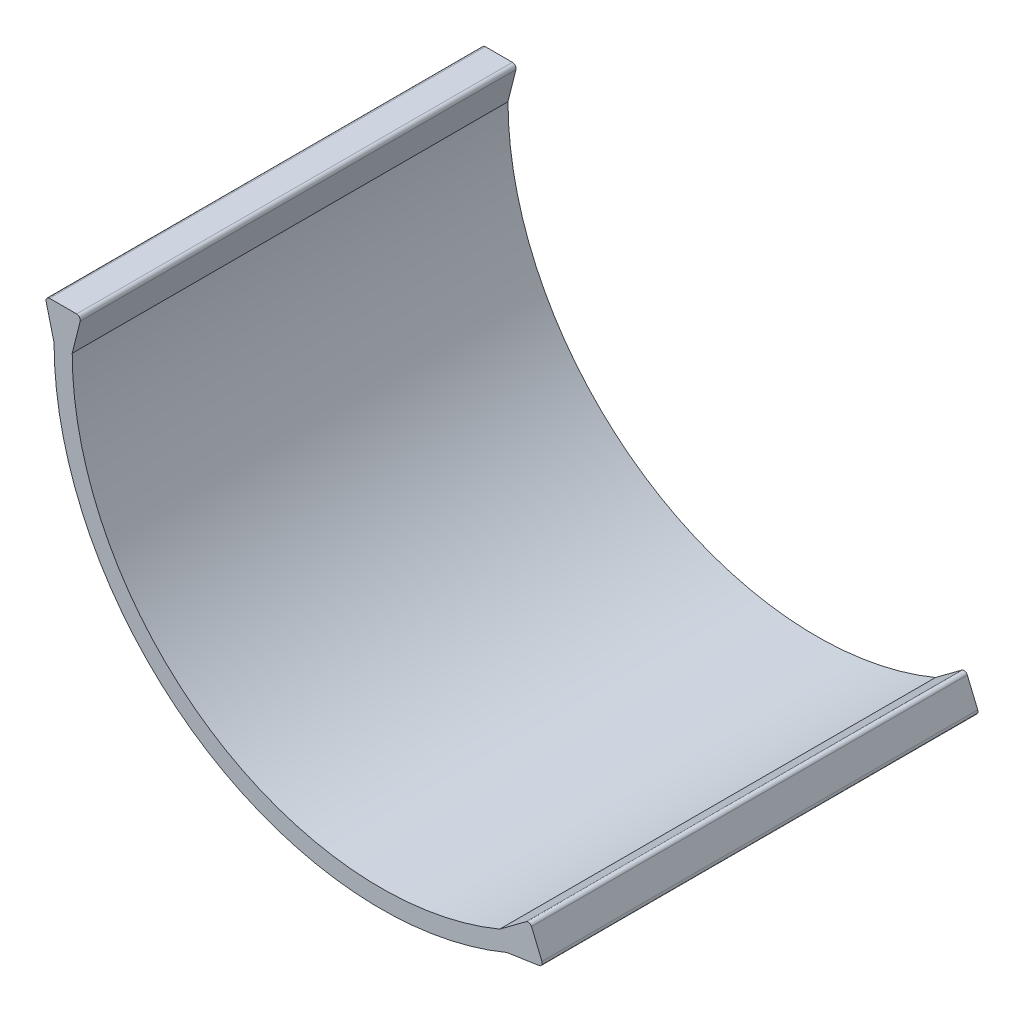
ISO-10303-21;
HEADER;
FILE_DESCRIPTION(('STEP AP214'),'2;1');
FILE_NAME('part.step','',(''),(''),'','','');
FILE_SCHEMA(('AUTOMOTIVE_DESIGN { 1 0 10303 214 1 1 1 1 }'));
ENDSEC;
DATA;
#1=APPLICATION_CONTEXT('core data for automotive mechanical design processes');
#2=APPLICATION_PROTOCOL_DEFINITION('international standard','automotive_design',2000,#1);
#3=PRODUCT_CONTEXT('',#1,'mechanical');
#4=PRODUCT('Part','Part','',(#3));
#5=PRODUCT_RELATED_PRODUCT_CATEGORY('part','',(#4));
#6=PRODUCT_DEFINITION_FORMATION('','',#4);
#7=PRODUCT_DEFINITION_CONTEXT('part definition',#1,'design');
#8=PRODUCT_DEFINITION('design','',#6,#7);
#9=PRODUCT_DEFINITION_SHAPE('','',#8);
#10=(LENGTH_UNIT() NAMED_UNIT(*) SI_UNIT(.MILLI.,.METRE.));
#11=(NAMED_UNIT(*) PLANE_ANGLE_UNIT() SI_UNIT($,.RADIAN.));
#12=(NAMED_UNIT(*) SI_UNIT($,.STERADIAN.) SOLID_ANGLE_UNIT());
#13=UNCERTAINTY_MEASURE_WITH_UNIT(LENGTH_MEASURE(1.E-05),#10,'distance_accuracy_value','');
#14=(GEOMETRIC_REPRESENTATION_CONTEXT(3) GLOBAL_UNCERTAINTY_ASSIGNED_CONTEXT((#13)) GLOBAL_UNIT_ASSIGNED_CONTEXT((#10,
#11,#12)) REPRESENTATION_CONTEXT('',''));
#15=CARTESIAN_POINT('',(0.,0.,0.));
#16=DIRECTION('',(0.,0.,1.));
#17=DIRECTION('',(1.,0.,0.));
#18=AXIS2_PLACEMENT_3D('',#15,#16,#17);
#19=CARTESIAN_POINT('',(0.,0.,120.));
#20=DIRECTION('',(0.,0.,-1.));
#21=DIRECTION('',(-1.,0.,0.));
#22=AXIS2_PLACEMENT_3D('',#19,#20,#21);
#23=CYLINDRICAL_SURFACE('',#22,90.);
#24=CARTESIAN_POINT('',(0.,0.,0.));
#25=DIRECTION('',(0.,0.,1.));
#26=DIRECTION('',(1.,0.,0.));
#27=AXIS2_PLACEMENT_3D('',#24,#25,#26);
#28=CIRCLE('',#27,90.);
#29=CARTESIAN_POINT('',(-90.,0.,0.));
#30=VERTEX_POINT('',#29);
#31=CARTESIAN_POINT('',(34.639883029955,-83.0667111644071,0.));
#32=VERTEX_POINT('',#31);
#33=EDGE_CURVE('E211',#30,#32,#28,.T.);
#34=ORIENTED_EDGE('',*,*,#33,.T.);
#35=DIRECTION('',(0.,0.,-1.));
#36=VECTOR('',#35,1.);
#37=CARTESIAN_POINT('',(34.639883029955,-83.0667111644071,120.));
#38=LINE('',#37,#36);
#39=CARTESIAN_POINT('',(34.639883029955,-83.0667111644071,120.));
#40=VERTEX_POINT('',#39);
#41=EDGE_CURVE('E12',#40,#32,#38,.T.);
#42=ORIENTED_EDGE('',*,*,#41,.F.);
#43=CARTESIAN_POINT('',(0.,0.,120.));
#44=DIRECTION('',(0.,0.,1.));
#45=DIRECTION('',(1.,0.,0.));
#46=AXIS2_PLACEMENT_3D('',#43,#44,#45);
#47=CIRCLE('',#46,90.);
#48=CARTESIAN_POINT('',(-90.,0.,120.));
#49=VERTEX_POINT('',#48);
#50=EDGE_CURVE('E217',#49,#40,#47,.T.);
#51=ORIENTED_EDGE('',*,*,#50,.F.);
#52=DIRECTION('',(0.,0.,-1.));
#53=VECTOR('',#52,1.);
#54=CARTESIAN_POINT('',(-90.,0.,120.));
#55=LINE('',#54,#53);
#56=EDGE_CURVE('E224',#49,#30,#55,.T.);
#57=ORIENTED_EDGE('',*,*,#56,.T.);
#58=EDGE_LOOP('',(#34,#42,#51,#57));
#59=FACE_BOUND('',#58,.T.);
#60=ADVANCED_FACE('F47',(#59),#23,.T.);
#61=CARTESIAN_POINT('',(0.,0.,120.));
#62=DIRECTION('',(0.,0.,-1.));
#63=DIRECTION('',(-1.,0.,0.));
#64=AXIS2_PLACEMENT_3D('',#61,#62,#63);
#65=CYLINDRICAL_SURFACE('',#64,85.);
#66=CARTESIAN_POINT('',(0.,0.,0.));
#67=DIRECTION('',(0.,0.,1.));
#68=DIRECTION('',(1.,0.,0.));
#69=AXIS2_PLACEMENT_3D('',#66,#67,#68);
#70=CIRCLE('',#69,85.);
#71=CARTESIAN_POINT('',(-85.,0.,0.));
#72=VERTEX_POINT('',#71);
#73=CARTESIAN_POINT('',(32.7154450838464,-78.4518938774956,0.));
#74=VERTEX_POINT('',#73);
#75=EDGE_CURVE('E221',#72,#74,#70,.T.);
#76=ORIENTED_EDGE('',*,*,#75,.F.);
#77=DIRECTION('',(0.,0.,-1.));
#78=VECTOR('',#77,1.);
#79=CARTESIAN_POINT('',(-85.,0.,120.));
#80=LINE('',#79,#78);
#81=CARTESIAN_POINT('',(-85.,0.,120.));
#82=VERTEX_POINT('',#81);
#83=EDGE_CURVE('E155',#82,#72,#80,.T.);
#84=ORIENTED_EDGE('',*,*,#83,.F.);
#85=CARTESIAN_POINT('',(0.,0.,120.));
#86=DIRECTION('',(0.,0.,1.));
#87=DIRECTION('',(1.,0.,0.));
#88=AXIS2_PLACEMENT_3D('',#85,#86,#87);
#89=CIRCLE('',#88,85.);
#90=CARTESIAN_POINT('',(32.7154450838464,-78.4518938774956,120.));
#91=VERTEX_POINT('',#90);
#92=EDGE_CURVE('E220',#82,#91,#89,.T.);
#93=ORIENTED_EDGE('',*,*,#92,.T.);
#94=DIRECTION('',(0.,0.,-1.));
#95=VECTOR('',#94,1.);
#96=CARTESIAN_POINT('',(32.7154450838464,-78.4518938774956,120.));
#97=LINE('',#96,#95);
#98=EDGE_CURVE('E54',#91,#74,#97,.T.);
#99=ORIENTED_EDGE('',*,*,#98,.T.);
#100=EDGE_LOOP('',(#76,#84,#93,#99));
#101=FACE_BOUND('',#100,.T.);
#102=ADVANCED_FACE('F232',(#101),#65,.F.);
#103=CARTESIAN_POINT('',(0.,0.,120.));
#104=DIRECTION('',(0.,0.,1.));
#105=DIRECTION('',(1.,0.,0.));
#106=AXIS2_PLACEMENT_3D('',#103,#104,#105);
#107=PLANE('',#106);
#108=ORIENTED_EDGE('',*,*,#50,.T.);
#109=DIRECTION('',(0.988755028108263,0.149544289060557,0.));
#110=VECTOR('',#109,1.);
#111=CARTESIAN_POINT('',(43.5653624651176,-81.716776712787,120.));
#112=LINE('',#111,#110);
#113=CARTESIAN_POINT('',(43.5653624651176,-81.716776712787,120.));
#114=VERTEX_POINT('',#113);
#115=EDGE_CURVE('E178',#40,#114,#112,.T.);
#116=ORIENTED_EDGE('',*,*,#115,.T.);
#117=CARTESIAN_POINT('',(43.415818176057,-80.7280216846787,120.));
#118=DIRECTION('',(0.,0.,1.));
#119=DIRECTION('',(-1.,0.,0.));
#120=AXIS2_PLACEMENT_3D('',#117,#118,#119);
#121=CIRCLE('',#120,0.999999999999995);
#122=CARTESIAN_POINT('',(44.3387816334393,-80.343134095457,120.));
#123=VERTEX_POINT('',#122);
#124=EDGE_CURVE('E198',#114,#123,#121,.T.);
#125=ORIENTED_EDGE('',*,*,#124,.T.);
#126=DIRECTION('',(-0.384887589221721,0.922963457382302,0.));
#127=VECTOR('',#126,1.);
#128=CARTESIAN_POINT('',(41.4758156280082,-73.4777191620114,120.));
#129=LINE('',#128,#127);
#130=CARTESIAN_POINT('',(41.4758156280082,-73.4777191620114,120.));
#131=VERTEX_POINT('',#130);
#132=EDGE_CURVE('E201',#123,#131,#129,.T.);
#133=ORIENTED_EDGE('',*,*,#132,.T.);
#134=CARTESIAN_POINT('',(40.5528521706259,-73.8626067512331,120.));
#135=DIRECTION('',(0.,0.,1.));
#136=DIRECTION('',(-1.,0.,0.));
#137=AXIS2_PLACEMENT_3D('',#134,#135,#136);
#138=CIRCLE('',#137,1.00000000000001);
#139=CARTESIAN_POINT('',(39.9556048435215,-73.060549627166,120.));
#140=VERTEX_POINT('',#139);
#141=EDGE_CURVE('E204',#131,#140,#138,.T.);
#142=ORIENTED_EDGE('',*,*,#141,.T.);
#143=DIRECTION('',(-0.80205712406703,-0.597247327104379,0.));
#144=VECTOR('',#143,1.);
#145=CARTESIAN_POINT('',(32.7154450838464,-78.4518938774956,120.));
#146=LINE('',#145,#144);
#147=EDGE_CURVE('E184',#140,#91,#146,.T.);
#148=ORIENTED_EDGE('',*,*,#147,.T.);
#149=ORIENTED_EDGE('',*,*,#92,.F.);
#150=DIRECTION('',(0.242535625036333,0.970142500145332,0.));
#151=VECTOR('',#150,1.);
#152=CARTESIAN_POINT('',(-82.8106339062591,8.75746437496367,120.));
#153=LINE('',#152,#151);
#154=CARTESIAN_POINT('',(-82.8106339062591,8.75746437496367,120.));
#155=VERTEX_POINT('',#154);
#156=EDGE_CURVE('E168',#82,#155,#153,.T.);
#157=ORIENTED_EDGE('',*,*,#156,.T.);
#158=CARTESIAN_POINT('',(-83.7807764064044,9.,120.));
#159=DIRECTION('',(0.,0.,1.));
#160=DIRECTION('',(-1.,0.,0.));
#161=AXIS2_PLACEMENT_3D('',#158,#159,#160);
#162=CIRCLE('',#161,1.);
#163=CARTESIAN_POINT('',(-83.7807764064044,10.,120.));
#164=VERTEX_POINT('',#163);
#165=EDGE_CURVE('E141',#155,#164,#162,.T.);
#166=ORIENTED_EDGE('',*,*,#165,.T.);
#167=DIRECTION('',(-1.,0.,0.));
#168=VECTOR('',#167,1.);
#169=CARTESIAN_POINT('',(-91.2192235935956,10.,120.));
#170=LINE('',#169,#168);
#171=CARTESIAN_POINT('',(-91.2192235935956,10.,120.));
#172=VERTEX_POINT('',#171);
#173=EDGE_CURVE('E171',#164,#172,#170,.T.);
#174=ORIENTED_EDGE('',*,*,#173,.T.);
#175=CARTESIAN_POINT('',(-91.2192235935956,9.,120.));
#176=DIRECTION('',(0.,0.,1.));
#177=DIRECTION('',(1.,0.,0.));
#178=AXIS2_PLACEMENT_3D('',#175,#176,#177);
#179=CIRCLE('',#178,1.);
#180=CARTESIAN_POINT('',(-92.1893660937409,8.75746437496367,120.));
#181=VERTEX_POINT('',#180);
#182=EDGE_CURVE('E160',#172,#181,#179,.T.);
#183=ORIENTED_EDGE('',*,*,#182,.T.);
#184=DIRECTION('',(0.242535625036333,-0.970142500145332,0.));
#185=VECTOR('',#184,1.);
#186=CARTESIAN_POINT('',(-90.,0.,120.));
#187=LINE('',#186,#185);
#188=EDGE_CURVE('E157',#181,#49,#187,.T.);
#189=ORIENTED_EDGE('',*,*,#188,.T.);
#190=EDGE_LOOP('',(#108,#116,#125,#133,#142,#148,#149,#157,#166,#174,#183,#189));
#191=FACE_BOUND('',#190,.T.);
#192=ADVANCED_FACE('F265',(#191),#107,.T.);
#193=CARTESIAN_POINT('',(0.,0.,0.));
#194=DIRECTION('',(0.,0.,1.));
#195=DIRECTION('',(1.,0.,0.));
#196=AXIS2_PLACEMENT_3D('',#193,#194,#195);
#197=PLANE('',#196);
#198=ORIENTED_EDGE('',*,*,#33,.F.);
#199=DIRECTION('',(0.242535625036333,-0.970142500145332,0.));
#200=VECTOR('',#199,1.);
#201=CARTESIAN_POINT('',(-90.,0.,0.));
#202=LINE('',#201,#200);
#203=CARTESIAN_POINT('',(-92.1893660937409,8.75746437496367,0.));
#204=VERTEX_POINT('',#203);
#205=EDGE_CURVE('E145',#204,#30,#202,.T.);
#206=ORIENTED_EDGE('',*,*,#205,.F.);
#207=CARTESIAN_POINT('',(-91.2192235935956,9.,0.));
#208=DIRECTION('',(0.,0.,1.));
#209=DIRECTION('',(1.,0.,0.));
#210=AXIS2_PLACEMENT_3D('',#207,#208,#209);
#211=CIRCLE('',#210,1.);
#212=CARTESIAN_POINT('',(-91.2192235935956,10.,0.));
#213=VERTEX_POINT('',#212);
#214=EDGE_CURVE('E164',#213,#204,#211,.T.);
#215=ORIENTED_EDGE('',*,*,#214,.F.);
#216=DIRECTION('',(-1.,0.,0.));
#217=VECTOR('',#216,1.);
#218=CARTESIAN_POINT('',(-91.2192235935956,10.,0.));
#219=LINE('',#218,#217);
#220=CARTESIAN_POINT('',(-83.7807764064044,10.,0.));
#221=VERTEX_POINT('',#220);
#222=EDGE_CURVE('E151',#221,#213,#219,.T.);
#223=ORIENTED_EDGE('',*,*,#222,.F.);
#224=CARTESIAN_POINT('',(-83.7807764064044,9.,0.));
#225=DIRECTION('',(0.,0.,1.));
#226=DIRECTION('',(-1.,0.,0.));
#227=AXIS2_PLACEMENT_3D('',#224,#225,#226);
#228=CIRCLE('',#227,1.);
#229=CARTESIAN_POINT('',(-82.8106339062591,8.75746437496367,0.));
#230=VERTEX_POINT('',#229);
#231=EDGE_CURVE('E139',#230,#221,#228,.T.);
#232=ORIENTED_EDGE('',*,*,#231,.F.);
#233=DIRECTION('',(0.242535625036333,0.970142500145332,0.));
#234=VECTOR('',#233,1.);
#235=CARTESIAN_POINT('',(-82.8106339062591,8.75746437496367,0.));
#236=LINE('',#235,#234);
#237=EDGE_CURVE('E61',#72,#230,#236,.T.);
#238=ORIENTED_EDGE('',*,*,#237,.F.);
#239=ORIENTED_EDGE('',*,*,#75,.T.);
#240=DIRECTION('',(-0.80205712406703,-0.597247327104379,0.));
#241=VECTOR('',#240,1.);
#242=CARTESIAN_POINT('',(32.7154450838464,-78.4518938774956,0.));
#243=LINE('',#242,#241);
#244=CARTESIAN_POINT('',(39.9556048435215,-73.060549627166,0.));
#245=VERTEX_POINT('',#244);
#246=EDGE_CURVE('E193',#245,#74,#243,.T.);
#247=ORIENTED_EDGE('',*,*,#246,.F.);
#248=CARTESIAN_POINT('',(40.5528521706259,-73.8626067512331,0.));
#249=DIRECTION('',(0.,0.,1.));
#250=DIRECTION('',(-1.,0.,0.));
#251=AXIS2_PLACEMENT_3D('',#248,#249,#250);
#252=CIRCLE('',#251,1.00000000000001);
#253=CARTESIAN_POINT('',(41.4758156280082,-73.4777191620114,0.));
#254=VERTEX_POINT('',#253);
#255=EDGE_CURVE('E190',#254,#245,#252,.T.);
#256=ORIENTED_EDGE('',*,*,#255,.F.);
#257=DIRECTION('',(-0.384887589221721,0.922963457382302,0.));
#258=VECTOR('',#257,1.);
#259=CARTESIAN_POINT('',(41.4758156280082,-73.4777191620114,0.));
#260=LINE('',#259,#258);
#261=CARTESIAN_POINT('',(44.3387816334393,-80.343134095457,0.));
#262=VERTEX_POINT('',#261);
#263=EDGE_CURVE('E187',#262,#254,#260,.T.);
#264=ORIENTED_EDGE('',*,*,#263,.F.);
#265=CARTESIAN_POINT('',(43.415818176057,-80.7280216846787,0.));
#266=DIRECTION('',(0.,0.,1.));
#267=DIRECTION('',(-1.,0.,0.));
#268=AXIS2_PLACEMENT_3D('',#265,#266,#267);
#269=CIRCLE('',#268,0.999999999999995);
#270=CARTESIAN_POINT('',(43.5653624651176,-81.716776712787,0.));
#271=VERTEX_POINT('',#270);
#272=EDGE_CURVE('E183',#271,#262,#269,.T.);
#273=ORIENTED_EDGE('',*,*,#272,.F.);
#274=DIRECTION('',(0.988755028108263,0.149544289060557,0.));
#275=VECTOR('',#274,1.);
#276=CARTESIAN_POINT('',(43.5653624651176,-81.716776712787,0.));
#277=LINE('',#276,#275);
#278=EDGE_CURVE('E68',#32,#271,#277,.T.);
#279=ORIENTED_EDGE('',*,*,#278,.F.);
#280=EDGE_LOOP('',(#198,#206,#215,#223,#232,#238,#239,#247,#256,#264,#273,#279));
#281=FACE_BOUND('',#280,.T.);
#282=ADVANCED_FACE('F148',(#281),#197,.F.);
#283=CARTESIAN_POINT('',(32.7154450838464,-78.4518938774956,0.));
#284=DIRECTION('',(-0.597247327104379,0.80205712406703,0.));
#285=DIRECTION('',(-0.80205712406703,-0.597247327104379,0.));
#286=AXIS2_PLACEMENT_3D('',#283,#284,#285);
#287=PLANE('',#286);
#288=ORIENTED_EDGE('',*,*,#147,.F.);
#289=DIRECTION('',(0.,0.,1.));
#290=VECTOR('',#289,1.);
#291=CARTESIAN_POINT('',(39.9556048435215,-73.060549627166,0.));
#292=LINE('',#291,#290);
#293=EDGE_CURVE('E209',#245,#140,#292,.T.);
#294=ORIENTED_EDGE('',*,*,#293,.F.);
#295=ORIENTED_EDGE('',*,*,#246,.T.);
#296=ORIENTED_EDGE('',*,*,#98,.F.);
#297=EDGE_LOOP('',(#288,#294,#295,#296));
#298=FACE_BOUND('',#297,.T.);
#299=ADVANCED_FACE('F239',(#298),#287,.T.);
#300=CARTESIAN_POINT('',(40.5528521706259,-73.8626067512331,0.));
#301=DIRECTION('',(0.,0.,1.));
#302=DIRECTION('',(1.,0.,0.));
#303=AXIS2_PLACEMENT_3D('',#300,#301,#302);
#304=CYLINDRICAL_SURFACE('',#303,1.00000000000001);
#305=ORIENTED_EDGE('',*,*,#141,.F.);
#306=DIRECTION('',(0.,0.,1.));
#307=VECTOR('',#306,1.);
#308=CARTESIAN_POINT('',(41.4758156280082,-73.4777191620114,0.));
#309=LINE('',#308,#307);
#310=EDGE_CURVE('E212',#254,#131,#309,.T.);
#311=ORIENTED_EDGE('',*,*,#310,.F.);
#312=ORIENTED_EDGE('',*,*,#255,.T.);
#313=ORIENTED_EDGE('',*,*,#293,.T.);
#314=EDGE_LOOP('',(#305,#311,#312,#313));
#315=FACE_BOUND('',#314,.T.);
#316=ADVANCED_FACE('F242',(#315),#304,.T.);
#317=CARTESIAN_POINT('',(41.4758156280082,-73.4777191620114,0.));
#318=DIRECTION('',(0.922963457382302,0.384887589221721,0.));
#319=DIRECTION('',(-0.384887589221721,0.922963457382302,0.));
#320=AXIS2_PLACEMENT_3D('',#317,#318,#319);
#321=PLANE('',#320);
#322=ORIENTED_EDGE('',*,*,#132,.F.);
#323=DIRECTION('',(0.,0.,1.));
#324=VECTOR('',#323,1.);
#325=CARTESIAN_POINT('',(44.3387816334393,-80.343134095457,0.));
#326=LINE('',#325,#324);
#327=EDGE_CURVE('E214',#262,#123,#326,.T.);
#328=ORIENTED_EDGE('',*,*,#327,.F.);
#329=ORIENTED_EDGE('',*,*,#263,.T.);
#330=ORIENTED_EDGE('',*,*,#310,.T.);
#331=EDGE_LOOP('',(#322,#328,#329,#330));
#332=FACE_BOUND('',#331,.T.);
#333=ADVANCED_FACE('F245',(#332),#321,.T.);
#334=CARTESIAN_POINT('',(43.415818176057,-80.7280216846787,0.));
#335=DIRECTION('',(0.,0.,1.));
#336=DIRECTION('',(1.,0.,0.));
#337=AXIS2_PLACEMENT_3D('',#334,#335,#336);
#338=CYLINDRICAL_SURFACE('',#337,0.999999999999995);
#339=ORIENTED_EDGE('',*,*,#124,.F.);
#340=DIRECTION('',(0.,0.,1.));
#341=VECTOR('',#340,1.);
#342=CARTESIAN_POINT('',(43.5653624651176,-81.716776712787,0.));
#343=LINE('',#342,#341);
#344=EDGE_CURVE('E195',#271,#114,#343,.T.);
#345=ORIENTED_EDGE('',*,*,#344,.F.);
#346=ORIENTED_EDGE('',*,*,#272,.T.);
#347=ORIENTED_EDGE('',*,*,#327,.T.);
#348=EDGE_LOOP('',(#339,#345,#346,#347));
#349=FACE_BOUND('',#348,.T.);
#350=ADVANCED_FACE('F248',(#349),#338,.T.);
#351=CARTESIAN_POINT('',(43.5653624651176,-81.716776712787,0.));
#352=DIRECTION('',(0.149544289060557,-0.988755028108263,0.));
#353=DIRECTION('',(0.988755028108263,0.149544289060557,0.));
#354=AXIS2_PLACEMENT_3D('',#351,#352,#353);
#355=PLANE('',#354);
#356=ORIENTED_EDGE('',*,*,#115,.F.);
#357=ORIENTED_EDGE('',*,*,#41,.T.);
#358=ORIENTED_EDGE('',*,*,#278,.T.);
#359=ORIENTED_EDGE('',*,*,#344,.T.);
#360=EDGE_LOOP('',(#356,#357,#358,#359));
#361=FACE_BOUND('',#360,.T.);
#362=ADVANCED_FACE('F250',(#361),#355,.T.);
#363=CARTESIAN_POINT('',(-90.,0.,0.));
#364=DIRECTION('',(-0.970142500145332,-0.242535625036333,0.));
#365=DIRECTION('',(0.242535625036333,-0.970142500145332,0.));
#366=AXIS2_PLACEMENT_3D('',#363,#364,#365);
#367=PLANE('',#366);
#368=ORIENTED_EDGE('',*,*,#188,.F.);
#369=DIRECTION('',(0.,0.,1.));
#370=VECTOR('',#369,1.);
#371=CARTESIAN_POINT('',(-92.1893660937409,8.75746437496367,0.));
#372=LINE('',#371,#370);
#373=EDGE_CURVE('E176',#204,#181,#372,.T.);
#374=ORIENTED_EDGE('',*,*,#373,.F.);
#375=ORIENTED_EDGE('',*,*,#205,.T.);
#376=ORIENTED_EDGE('',*,*,#56,.F.);
#377=EDGE_LOOP('',(#368,#374,#375,#376));
#378=FACE_BOUND('',#377,.T.);
#379=ADVANCED_FACE('F257',(#378),#367,.T.);
#380=CARTESIAN_POINT('',(-91.2192235935956,9.,0.));
#381=DIRECTION('',(0.,0.,1.));
#382=DIRECTION('',(1.,0.,0.));
#383=AXIS2_PLACEMENT_3D('',#380,#381,#382);
#384=CYLINDRICAL_SURFACE('',#383,1.);
#385=ORIENTED_EDGE('',*,*,#182,.F.);
#386=DIRECTION('',(0.,0.,1.));
#387=VECTOR('',#386,1.);
#388=CARTESIAN_POINT('',(-91.2192235935956,10.,0.));
#389=LINE('',#388,#387);
#390=EDGE_CURVE('E179',#213,#172,#389,.T.);
#391=ORIENTED_EDGE('',*,*,#390,.F.);
#392=ORIENTED_EDGE('',*,*,#214,.T.);
#393=ORIENTED_EDGE('',*,*,#373,.T.);
#394=EDGE_LOOP('',(#385,#391,#392,#393));
#395=FACE_BOUND('',#394,.T.);
#396=ADVANCED_FACE('F260',(#395),#384,.T.);
#397=CARTESIAN_POINT('',(-91.2192235935956,10.,0.));
#398=DIRECTION('',(0.,1.,0.));
#399=DIRECTION('',(-1.,0.,0.));
#400=AXIS2_PLACEMENT_3D('',#397,#398,#399);
#401=PLANE('',#400);
#402=ORIENTED_EDGE('',*,*,#173,.F.);
#403=DIRECTION('',(0.,0.,1.));
#404=VECTOR('',#403,1.);
#405=CARTESIAN_POINT('',(-83.7807764064044,10.,0.));
#406=LINE('',#405,#404);
#407=EDGE_CURVE('E144',#221,#164,#406,.T.);
#408=ORIENTED_EDGE('',*,*,#407,.F.);
#409=ORIENTED_EDGE('',*,*,#222,.T.);
#410=ORIENTED_EDGE('',*,*,#390,.T.);
#411=EDGE_LOOP('',(#402,#408,#409,#410));
#412=FACE_BOUND('',#411,.T.);
#413=ADVANCED_FACE('F263',(#412),#401,.T.);
#414=CARTESIAN_POINT('',(-83.7807764064044,9.,0.));
#415=DIRECTION('',(0.,0.,1.));
#416=DIRECTION('',(1.,0.,0.));
#417=AXIS2_PLACEMENT_3D('',#414,#415,#416);
#418=CYLINDRICAL_SURFACE('',#417,1.);
#419=ORIENTED_EDGE('',*,*,#165,.F.);
#420=DIRECTION('',(0.,0.,1.));
#421=VECTOR('',#420,1.);
#422=CARTESIAN_POINT('',(-82.8106339062591,8.75746437496367,0.));
#423=LINE('',#422,#421);
#424=EDGE_CURVE('E137',#230,#155,#423,.T.);
#425=ORIENTED_EDGE('',*,*,#424,.F.);
#426=ORIENTED_EDGE('',*,*,#231,.T.);
#427=ORIENTED_EDGE('',*,*,#407,.T.);
#428=EDGE_LOOP('',(#419,#425,#426,#427));
#429=FACE_BOUND('',#428,.T.);
#430=ADVANCED_FACE('F138',(#429),#418,.T.);
#431=CARTESIAN_POINT('',(-82.8106339062591,8.75746437496367,0.));
#432=DIRECTION('',(0.970142500145332,-0.242535625036333,0.));
#433=DIRECTION('',(0.242535625036333,0.970142500145332,0.));
#434=AXIS2_PLACEMENT_3D('',#431,#432,#433);
#435=PLANE('',#434);
#436=ORIENTED_EDGE('',*,*,#156,.F.);
#437=ORIENTED_EDGE('',*,*,#83,.T.);
#438=ORIENTED_EDGE('',*,*,#237,.T.);
#439=ORIENTED_EDGE('',*,*,#424,.T.);
#440=EDGE_LOOP('',(#436,#437,#438,#439));
#441=FACE_BOUND('',#440,.T.);
#442=ADVANCED_FACE('F153',(#441),#435,.T.);
#443=CLOSED_SHELL('',(#60,#102,#192,#282,#299,#316,#333,#350,#362,#379,#396,#413,#430,#442));
#444=MANIFOLD_SOLID_BREP('B2',#443);
#445=ADVANCED_BREP_SHAPE_REPRESENTATION('',(#18,#444),#14);
#446=SHAPE_DEFINITION_REPRESENTATION(#9,#445);
ENDSEC;
END-ISO-10303-21;
